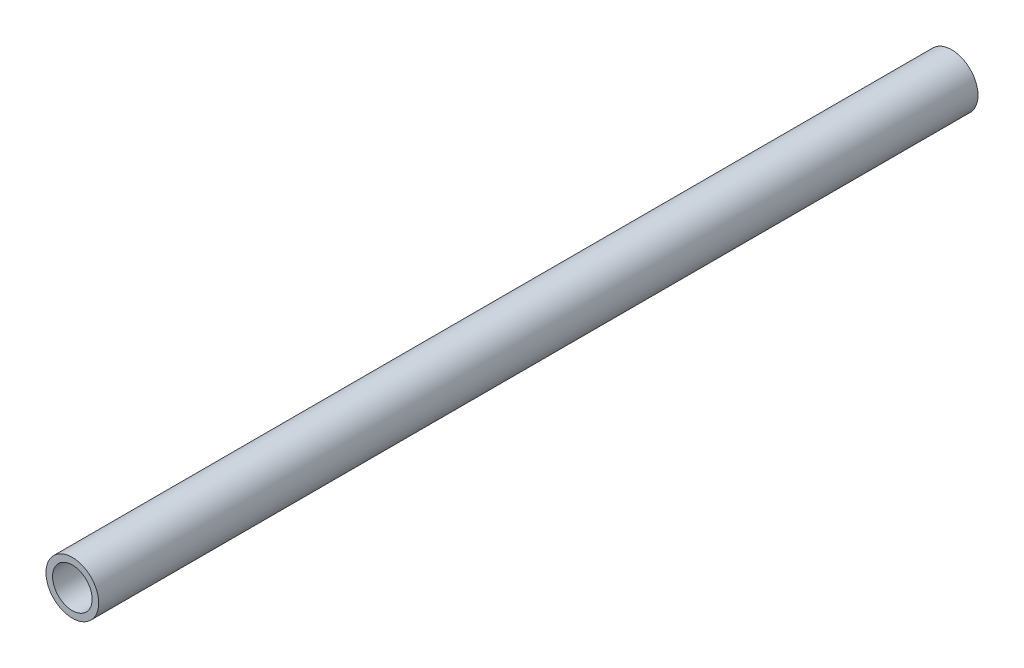
ISO-10303-21;
HEADER;
FILE_DESCRIPTION(('STEP AP214'),'2;1');
FILE_NAME('part.step','',(''),(''),'','','');
FILE_SCHEMA(('AUTOMOTIVE_DESIGN { 1 0 10303 214 1 1 1 1 }'));
ENDSEC;
DATA;
#1=APPLICATION_CONTEXT('core data for automotive mechanical design processes');
#2=APPLICATION_PROTOCOL_DEFINITION('international standard','automotive_design',2000,#1);
#3=PRODUCT_CONTEXT('',#1,'mechanical');
#4=PRODUCT('Part','Part','',(#3));
#5=PRODUCT_RELATED_PRODUCT_CATEGORY('part','',(#4));
#6=PRODUCT_DEFINITION_FORMATION('','',#4);
#7=PRODUCT_DEFINITION_CONTEXT('part definition',#1,'design');
#8=PRODUCT_DEFINITION('design','',#6,#7);
#9=PRODUCT_DEFINITION_SHAPE('','',#8);
#10=(LENGTH_UNIT() NAMED_UNIT(*) SI_UNIT(.MILLI.,.METRE.));
#11=(NAMED_UNIT(*) PLANE_ANGLE_UNIT() SI_UNIT($,.RADIAN.));
#12=(NAMED_UNIT(*) SI_UNIT($,.STERADIAN.) SOLID_ANGLE_UNIT());
#13=UNCERTAINTY_MEASURE_WITH_UNIT(LENGTH_MEASURE(1.E-05),#10,'distance_accuracy_value','');
#14=(GEOMETRIC_REPRESENTATION_CONTEXT(3) GLOBAL_UNCERTAINTY_ASSIGNED_CONTEXT((#13)) GLOBAL_UNIT_ASSIGNED_CONTEXT((#10,
#11,#12)) REPRESENTATION_CONTEXT('',''));
#15=CARTESIAN_POINT('',(0.,0.,0.));
#16=DIRECTION('',(0.,0.,1.));
#17=DIRECTION('',(1.,0.,0.));
#18=AXIS2_PLACEMENT_3D('',#15,#16,#17);
#19=CARTESIAN_POINT('',(0.,0.,100.));
#20=DIRECTION('',(0.,0.,-1.));
#21=DIRECTION('',(-1.,0.,0.));
#22=AXIS2_PLACEMENT_3D('',#19,#20,#21);
#23=CYLINDRICAL_SURFACE('',#22,6.);
#24=CARTESIAN_POINT('',(0.,0.,100.));
#25=DIRECTION('',(0.,0.,1.));
#26=DIRECTION('',(1.,0.,0.));
#27=AXIS2_PLACEMENT_3D('',#24,#25,#26);
#28=CIRCLE('',#27,6.);
#29=CARTESIAN_POINT('',(6.,0.,100.));
#30=VERTEX_POINT('',#29);
#31=EDGE_CURVE('E10',#30,#30,#28,.T.);
#32=ORIENTED_EDGE('',*,*,#31,.F.);
#33=EDGE_LOOP('',(#32));
#34=FACE_BOUND('',#33,.T.);
#35=CARTESIAN_POINT('',(0.,0.,-100.));
#36=DIRECTION('',(0.,0.,1.));
#37=DIRECTION('',(1.,0.,0.));
#38=AXIS2_PLACEMENT_3D('',#35,#36,#37);
#39=CIRCLE('',#38,6.);
#40=CARTESIAN_POINT('',(6.,0.,-100.));
#41=VERTEX_POINT('',#40);
#42=EDGE_CURVE('E40',#41,#41,#39,.T.);
#43=ORIENTED_EDGE('',*,*,#42,.T.);
#44=EDGE_LOOP('',(#43));
#45=FACE_BOUND('',#44,.T.);
#46=ADVANCED_FACE('F37',(#34,#45),#23,.T.);
#47=CARTESIAN_POINT('',(0.,0.,100.));
#48=DIRECTION('',(0.,0.,1.));
#49=DIRECTION('',(1.,0.,0.));
#50=AXIS2_PLACEMENT_3D('',#47,#48,#49);
#51=PLANE('',#50);
#52=CARTESIAN_POINT('',(0.,0.,100.));
#53=DIRECTION('',(0.,0.,1.));
#54=DIRECTION('',(1.,0.,0.));
#55=AXIS2_PLACEMENT_3D('',#52,#53,#54);
#56=CIRCLE('',#55,4.5);
#57=CARTESIAN_POINT('',(4.5,0.,100.));
#58=VERTEX_POINT('',#57);
#59=EDGE_CURVE('E51',#58,#58,#56,.T.);
#60=ORIENTED_EDGE('',*,*,#59,.F.);
#61=EDGE_LOOP('',(#60));
#62=FACE_BOUND('',#61,.T.);
#63=ORIENTED_EDGE('',*,*,#31,.T.);
#64=EDGE_LOOP('',(#63));
#65=FACE_BOUND('',#64,.T.);
#66=ADVANCED_FACE('F68',(#62,#65),#51,.T.);
#67=CARTESIAN_POINT('',(0.,0.,-100.));
#68=DIRECTION('',(0.,0.,1.));
#69=DIRECTION('',(1.,0.,0.));
#70=AXIS2_PLACEMENT_3D('',#67,#68,#69);
#71=PLANE('',#70);
#72=CARTESIAN_POINT('',(0.,0.,-100.));
#73=DIRECTION('',(0.,0.,1.));
#74=DIRECTION('',(1.,0.,0.));
#75=AXIS2_PLACEMENT_3D('',#72,#73,#74);
#76=CIRCLE('',#75,4.5);
#77=CARTESIAN_POINT('',(4.5,0.,-100.));
#78=VERTEX_POINT('',#77);
#79=EDGE_CURVE('E49',#78,#78,#76,.T.);
#80=ORIENTED_EDGE('',*,*,#79,.T.);
#81=EDGE_LOOP('',(#80));
#82=FACE_BOUND('',#81,.T.);
#83=ORIENTED_EDGE('',*,*,#42,.F.);
#84=EDGE_LOOP('',(#83));
#85=FACE_BOUND('',#84,.T.);
#86=ADVANCED_FACE('F59',(#82,#85),#71,.F.);
#87=CARTESIAN_POINT('',(0.,0.,-100.));
#88=DIRECTION('',(0.,0.,1.));
#89=DIRECTION('',(1.,0.,0.));
#90=AXIS2_PLACEMENT_3D('',#87,#88,#89);
#91=CYLINDRICAL_SURFACE('',#90,4.5);
#92=ORIENTED_EDGE('',*,*,#79,.F.);
#93=EDGE_LOOP('',(#92));
#94=FACE_BOUND('',#93,.T.);
#95=ORIENTED_EDGE('',*,*,#59,.T.);
#96=EDGE_LOOP('',(#95));
#97=FACE_BOUND('',#96,.T.);
#98=ADVANCED_FACE('F62',(#94,#97),#91,.F.);
#99=CLOSED_SHELL('',(#46,#66,#86,#98));
#100=MANIFOLD_SOLID_BREP('B2',#99);
#101=ADVANCED_BREP_SHAPE_REPRESENTATION('',(#18,#100),#14);
#102=SHAPE_DEFINITION_REPRESENTATION(#9,#101);
ENDSEC;
END-ISO-10303-21;
